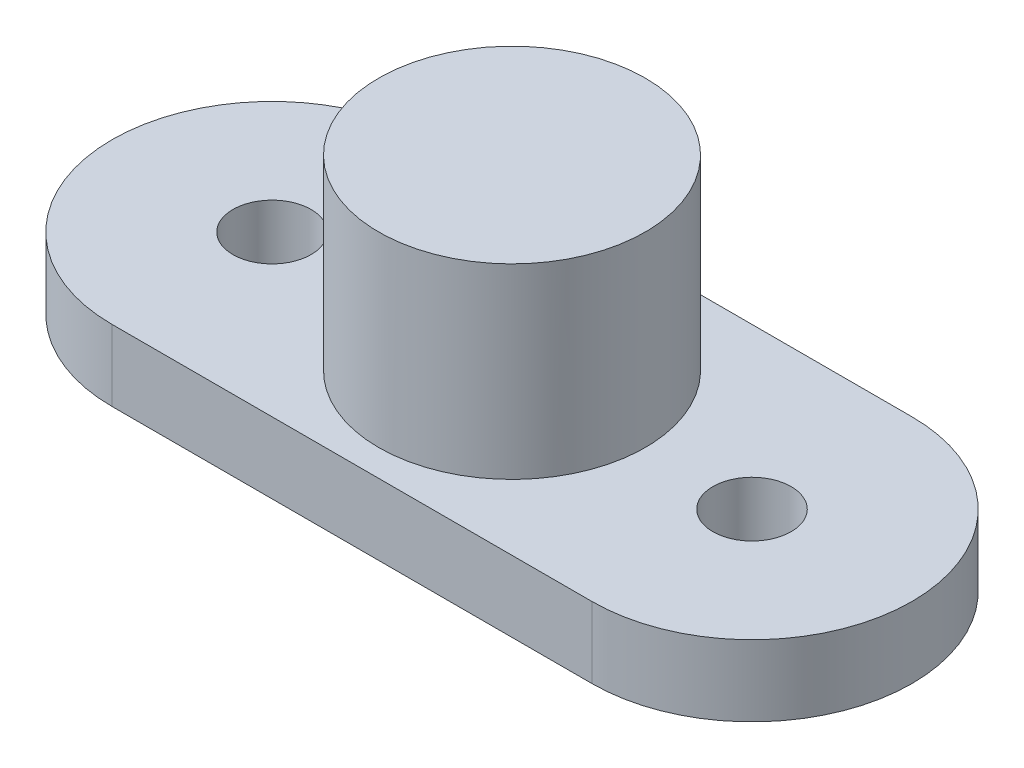
ISO-10303-21;
HEADER;
FILE_DESCRIPTION(('STEP AP214'),'2;1');
FILE_NAME('part.step','',(''),(''),'','','');
FILE_SCHEMA(('AUTOMOTIVE_DESIGN { 1 0 10303 214 1 1 1 1 }'));
ENDSEC;
DATA;
#1=APPLICATION_CONTEXT('core data for automotive mechanical design processes');
#2=APPLICATION_PROTOCOL_DEFINITION('international standard','automotive_design',2000,#1);
#3=PRODUCT_CONTEXT('',#1,'mechanical');
#4=PRODUCT('Part','Part','',(#3));
#5=PRODUCT_RELATED_PRODUCT_CATEGORY('part','',(#4));
#6=PRODUCT_DEFINITION_FORMATION('','',#4);
#7=PRODUCT_DEFINITION_CONTEXT('part definition',#1,'design');
#8=PRODUCT_DEFINITION('design','',#6,#7);
#9=PRODUCT_DEFINITION_SHAPE('','',#8);
#10=(LENGTH_UNIT() NAMED_UNIT(*) SI_UNIT(.MILLI.,.METRE.));
#11=(NAMED_UNIT(*) PLANE_ANGLE_UNIT() SI_UNIT($,.RADIAN.));
#12=(NAMED_UNIT(*) SI_UNIT($,.STERADIAN.) SOLID_ANGLE_UNIT());
#13=UNCERTAINTY_MEASURE_WITH_UNIT(LENGTH_MEASURE(1.E-05),#10,'distance_accuracy_value','');
#14=(GEOMETRIC_REPRESENTATION_CONTEXT(3) GLOBAL_UNCERTAINTY_ASSIGNED_CONTEXT((#13)) GLOBAL_UNIT_ASSIGNED_CONTEXT((#10,
#11,#12)) REPRESENTATION_CONTEXT('',''));
#15=CARTESIAN_POINT('',(0.,0.,0.));
#16=DIRECTION('',(0.,0.,1.));
#17=DIRECTION('',(1.,0.,0.));
#18=AXIS2_PLACEMENT_3D('',#15,#16,#17);
#19=CARTESIAN_POINT('',(0.,2.,-4.49950296687665));
#20=DIRECTION('',(0.,0.,-1.));
#21=DIRECTION('',(-1.,0.,0.));
#22=AXIS2_PLACEMENT_3D('',#19,#20,#21);
#23=PLANE('',#22);
#24=DIRECTION('',(1.,0.,0.));
#25=VECTOR('',#24,1.);
#26=CARTESIAN_POINT('',(0.,0.,-4.49950296687665));
#27=LINE('',#26,#25);
#28=CARTESIAN_POINT('',(-6.75,0.,-4.49950296687665));
#29=VERTEX_POINT('',#28);
#30=CARTESIAN_POINT('',(6.75,0.,-4.49950296687665));
#31=VERTEX_POINT('',#30);
#32=EDGE_CURVE('E119',#29,#31,#27,.T.);
#33=ORIENTED_EDGE('',*,*,#32,.F.);
#34=DIRECTION('',(0.,-1.,0.));
#35=VECTOR('',#34,1.);
#36=CARTESIAN_POINT('',(-6.75,2.,-4.49950296687665));
#37=LINE('',#36,#35);
#38=CARTESIAN_POINT('',(-6.75,2.,-4.49950296687665));
#39=VERTEX_POINT('',#38);
#40=EDGE_CURVE('E11',#39,#29,#37,.T.);
#41=ORIENTED_EDGE('',*,*,#40,.F.);
#42=DIRECTION('',(1.,0.,0.));
#43=VECTOR('',#42,1.);
#44=CARTESIAN_POINT('',(0.,2.,-4.49950296687665));
#45=LINE('',#44,#43);
#46=CARTESIAN_POINT('',(6.75,2.,-4.49950296687665));
#47=VERTEX_POINT('',#46);
#48=EDGE_CURVE('E96',#39,#47,#45,.T.);
#49=ORIENTED_EDGE('',*,*,#48,.T.);
#50=DIRECTION('',(0.,-1.,0.));
#51=VECTOR('',#50,1.);
#52=CARTESIAN_POINT('',(6.75,2.,-4.49950296687665));
#53=LINE('',#52,#51);
#54=EDGE_CURVE('E57',#47,#31,#53,.T.);
#55=ORIENTED_EDGE('',*,*,#54,.T.);
#56=EDGE_LOOP('',(#33,#41,#49,#55));
#57=FACE_BOUND('',#56,.T.);
#58=ADVANCED_FACE('F39',(#57),#23,.T.);
#59=CARTESIAN_POINT('',(-6.75,2.,0.));
#60=DIRECTION('',(0.,-1.,0.));
#61=DIRECTION('',(0.,0.,-1.));
#62=AXIS2_PLACEMENT_3D('',#59,#60,#61);
#63=CYLINDRICAL_SURFACE('',#62,4.49950296687665);
#64=CARTESIAN_POINT('',(-6.75,0.,0.));
#65=DIRECTION('',(0.,1.,0.));
#66=DIRECTION('',(0.,0.,1.));
#67=AXIS2_PLACEMENT_3D('',#64,#65,#66);
#68=CIRCLE('',#67,4.49950296687665);
#69=CARTESIAN_POINT('',(-6.75,0.,4.49950296687665));
#70=VERTEX_POINT('',#69);
#71=EDGE_CURVE('E102',#29,#70,#68,.T.);
#72=ORIENTED_EDGE('',*,*,#71,.T.);
#73=DIRECTION('',(0.,-1.,0.));
#74=VECTOR('',#73,1.);
#75=CARTESIAN_POINT('',(-6.75,2.,4.49950296687665));
#76=LINE('',#75,#74);
#77=CARTESIAN_POINT('',(-6.75,2.,4.49950296687665));
#78=VERTEX_POINT('',#77);
#79=EDGE_CURVE('E49',#78,#70,#76,.T.);
#80=ORIENTED_EDGE('',*,*,#79,.F.);
#81=CARTESIAN_POINT('',(-6.75,2.,0.));
#82=DIRECTION('',(0.,1.,0.));
#83=DIRECTION('',(0.,0.,1.));
#84=AXIS2_PLACEMENT_3D('',#81,#82,#83);
#85=CIRCLE('',#84,4.49950296687665);
#86=EDGE_CURVE('E92',#39,#78,#85,.T.);
#87=ORIENTED_EDGE('',*,*,#86,.F.);
#88=ORIENTED_EDGE('',*,*,#40,.T.);
#89=EDGE_LOOP('',(#72,#80,#87,#88));
#90=FACE_BOUND('',#89,.T.);
#91=ADVANCED_FACE('F100',(#90),#63,.T.);
#92=CARTESIAN_POINT('',(0.,2.,4.49950296687665));
#93=DIRECTION('',(0.,0.,-1.));
#94=DIRECTION('',(-1.,0.,0.));
#95=AXIS2_PLACEMENT_3D('',#92,#93,#94);
#96=PLANE('',#95);
#97=DIRECTION('',(1.,0.,0.));
#98=VECTOR('',#97,1.);
#99=CARTESIAN_POINT('',(0.,0.,4.49950296687665));
#100=LINE('',#99,#98);
#101=CARTESIAN_POINT('',(6.75,0.,4.49950296687665));
#102=VERTEX_POINT('',#101);
#103=EDGE_CURVE('E114',#70,#102,#100,.T.);
#104=ORIENTED_EDGE('',*,*,#103,.T.);
#105=DIRECTION('',(0.,-1.,0.));
#106=VECTOR('',#105,1.);
#107=CARTESIAN_POINT('',(6.75,2.,4.49950296687665));
#108=LINE('',#107,#106);
#109=CARTESIAN_POINT('',(6.75,2.,4.49950296687665));
#110=VERTEX_POINT('',#109);
#111=EDGE_CURVE('E71',#110,#102,#108,.T.);
#112=ORIENTED_EDGE('',*,*,#111,.F.);
#113=DIRECTION('',(1.,0.,0.));
#114=VECTOR('',#113,1.);
#115=CARTESIAN_POINT('',(0.,2.,4.49950296687665));
#116=LINE('',#115,#114);
#117=EDGE_CURVE('E83',#78,#110,#116,.T.);
#118=ORIENTED_EDGE('',*,*,#117,.F.);
#119=ORIENTED_EDGE('',*,*,#79,.T.);
#120=EDGE_LOOP('',(#104,#112,#118,#119));
#121=FACE_BOUND('',#120,.T.);
#122=ADVANCED_FACE('F85',(#121),#96,.F.);
#123=CARTESIAN_POINT('',(-6.75,2.,0.));
#124=DIRECTION('',(0.,-1.,0.));
#125=DIRECTION('',(0.,0.,-1.));
#126=AXIS2_PLACEMENT_3D('',#123,#124,#125);
#127=CYLINDRICAL_SURFACE('',#126,1.1);
#128=CARTESIAN_POINT('',(-6.75,2.,0.));
#129=DIRECTION('',(0.,1.,0.));
#130=DIRECTION('',(0.,0.,1.));
#131=AXIS2_PLACEMENT_3D('',#128,#129,#130);
#132=CIRCLE('',#131,1.1);
#133=CARTESIAN_POINT('',(-6.75,2.,1.1));
#134=VERTEX_POINT('',#133);
#135=EDGE_CURVE('E139',#134,#134,#132,.T.);
#136=ORIENTED_EDGE('',*,*,#135,.T.);
#137=EDGE_LOOP('',(#136));
#138=FACE_BOUND('',#137,.T.);
#139=CARTESIAN_POINT('',(-6.75,0.,0.));
#140=DIRECTION('',(0.,1.,0.));
#141=DIRECTION('',(0.,0.,1.));
#142=AXIS2_PLACEMENT_3D('',#139,#140,#141);
#143=CIRCLE('',#142,1.1);
#144=CARTESIAN_POINT('',(-6.75,0.,1.1));
#145=VERTEX_POINT('',#144);
#146=EDGE_CURVE('E122',#145,#145,#143,.T.);
#147=ORIENTED_EDGE('',*,*,#146,.F.);
#148=EDGE_LOOP('',(#147));
#149=FACE_BOUND('',#148,.T.);
#150=ADVANCED_FACE('F168',(#138,#149),#127,.F.);
#151=CARTESIAN_POINT('',(6.75,2.,0.));
#152=DIRECTION('',(0.,-1.,0.));
#153=DIRECTION('',(0.,0.,-1.));
#154=AXIS2_PLACEMENT_3D('',#151,#152,#153);
#155=CYLINDRICAL_SURFACE('',#154,1.1);
#156=CARTESIAN_POINT('',(6.75,2.,0.));
#157=DIRECTION('',(0.,1.,0.));
#158=DIRECTION('',(0.,0.,1.));
#159=AXIS2_PLACEMENT_3D('',#156,#157,#158);
#160=CIRCLE('',#159,1.1);
#161=CARTESIAN_POINT('',(6.75,2.,1.1));
#162=VERTEX_POINT('',#161);
#163=EDGE_CURVE('E113',#162,#162,#160,.T.);
#164=ORIENTED_EDGE('',*,*,#163,.T.);
#165=EDGE_LOOP('',(#164));
#166=FACE_BOUND('',#165,.T.);
#167=CARTESIAN_POINT('',(6.75,0.,0.));
#168=DIRECTION('',(0.,1.,0.));
#169=DIRECTION('',(0.,0.,1.));
#170=AXIS2_PLACEMENT_3D('',#167,#168,#169);
#171=CIRCLE('',#170,1.1);
#172=CARTESIAN_POINT('',(6.75,0.,1.1));
#173=VERTEX_POINT('',#172);
#174=EDGE_CURVE('E126',#173,#173,#171,.T.);
#175=ORIENTED_EDGE('',*,*,#174,.F.);
#176=EDGE_LOOP('',(#175));
#177=FACE_BOUND('',#176,.T.);
#178=ADVANCED_FACE('F41',(#166,#177),#155,.F.);
#179=CARTESIAN_POINT('',(6.75,2.,0.));
#180=DIRECTION('',(0.,-1.,0.));
#181=DIRECTION('',(0.,0.,-1.));
#182=AXIS2_PLACEMENT_3D('',#179,#180,#181);
#183=CYLINDRICAL_SURFACE('',#182,4.49950296687665);
#184=CARTESIAN_POINT('',(6.75,0.,0.));
#185=DIRECTION('',(0.,1.,0.));
#186=DIRECTION('',(0.,0.,1.));
#187=AXIS2_PLACEMENT_3D('',#184,#185,#186);
#188=CIRCLE('',#187,4.49950296687665);
#189=EDGE_CURVE('E109',#31,#102,#188,.F.);
#190=ORIENTED_EDGE('',*,*,#189,.F.);
#191=ORIENTED_EDGE('',*,*,#54,.F.);
#192=CARTESIAN_POINT('',(6.75,2.,0.));
#193=DIRECTION('',(0.,1.,0.));
#194=DIRECTION('',(0.,0.,1.));
#195=AXIS2_PLACEMENT_3D('',#192,#193,#194);
#196=CIRCLE('',#195,4.49950296687665);
#197=EDGE_CURVE('E91',#47,#110,#196,.F.);
#198=ORIENTED_EDGE('',*,*,#197,.T.);
#199=ORIENTED_EDGE('',*,*,#111,.T.);
#200=EDGE_LOOP('',(#190,#191,#198,#199));
#201=FACE_BOUND('',#200,.T.);
#202=ADVANCED_FACE('F175',(#201),#183,.T.);
#203=CARTESIAN_POINT('',(0.,2.,0.));
#204=DIRECTION('',(0.,1.,0.));
#205=DIRECTION('',(0.,0.,1.));
#206=AXIS2_PLACEMENT_3D('',#203,#204,#205);
#207=PLANE('',#206);
#208=ORIENTED_EDGE('',*,*,#163,.F.);
#209=EDGE_LOOP('',(#208));
#210=FACE_BOUND('',#209,.T.);
#211=ORIENTED_EDGE('',*,*,#135,.F.);
#212=EDGE_LOOP('',(#211));
#213=FACE_BOUND('',#212,.T.);
#214=CARTESIAN_POINT('',(0.,2.,0.));
#215=DIRECTION('',(0.,1.,0.));
#216=DIRECTION('',(0.,0.,1.));
#217=AXIS2_PLACEMENT_3D('',#214,#215,#216);
#218=CIRCLE('',#217,3.75);
#219=CARTESIAN_POINT('',(0.,2.,3.75));
#220=VERTEX_POINT('',#219);
#221=EDGE_CURVE('E135',#220,#220,#218,.T.);
#222=ORIENTED_EDGE('',*,*,#221,.F.);
#223=EDGE_LOOP('',(#222));
#224=FACE_BOUND('',#223,.T.);
#225=ORIENTED_EDGE('',*,*,#48,.F.);
#226=ORIENTED_EDGE('',*,*,#86,.T.);
#227=ORIENTED_EDGE('',*,*,#117,.T.);
#228=ORIENTED_EDGE('',*,*,#197,.F.);
#229=EDGE_LOOP('',(#225,#226,#227,#228));
#230=FACE_BOUND('',#229,.T.);
#231=ADVANCED_FACE('F95',(#210,#213,#224,#230),#207,.T.);
#232=CARTESIAN_POINT('',(0.,0.,0.));
#233=DIRECTION('',(0.,1.,0.));
#234=DIRECTION('',(0.,0.,1.));
#235=AXIS2_PLACEMENT_3D('',#232,#233,#234);
#236=PLANE('',#235);
#237=ORIENTED_EDGE('',*,*,#174,.T.);
#238=EDGE_LOOP('',(#237));
#239=FACE_BOUND('',#238,.T.);
#240=ORIENTED_EDGE('',*,*,#146,.T.);
#241=EDGE_LOOP('',(#240));
#242=FACE_BOUND('',#241,.T.);
#243=ORIENTED_EDGE('',*,*,#32,.T.);
#244=ORIENTED_EDGE('',*,*,#189,.T.);
#245=ORIENTED_EDGE('',*,*,#103,.F.);
#246=ORIENTED_EDGE('',*,*,#71,.F.);
#247=EDGE_LOOP('',(#243,#244,#245,#246));
#248=FACE_BOUND('',#247,.T.);
#249=ADVANCED_FACE('F158',(#239,#242,#248),#236,.F.);
#250=CARTESIAN_POINT('',(0.,7.25,0.));
#251=DIRECTION('',(0.,-1.,0.));
#252=DIRECTION('',(0.,0.,-1.));
#253=AXIS2_PLACEMENT_3D('',#250,#251,#252);
#254=CYLINDRICAL_SURFACE('',#253,3.75);
#255=ORIENTED_EDGE('',*,*,#221,.T.);
#256=EDGE_LOOP('',(#255));
#257=FACE_BOUND('',#256,.T.);
#258=CARTESIAN_POINT('',(0.,7.25,0.));
#259=DIRECTION('',(0.,-1.,0.));
#260=DIRECTION('',(0.,0.,-1.));
#261=AXIS2_PLACEMENT_3D('',#258,#259,#260);
#262=CIRCLE('',#261,3.75);
#263=CARTESIAN_POINT('',(0.,7.25,-3.75));
#264=VERTEX_POINT('',#263);
#265=EDGE_CURVE('E130',#264,#264,#262,.T.);
#266=ORIENTED_EDGE('',*,*,#265,.T.);
#267=EDGE_LOOP('',(#266));
#268=FACE_BOUND('',#267,.T.);
#269=ADVANCED_FACE('F150',(#257,#268),#254,.T.);
#270=CARTESIAN_POINT('',(0.,7.25,0.));
#271=DIRECTION('',(0.,-1.,0.));
#272=DIRECTION('',(0.,0.,-1.));
#273=AXIS2_PLACEMENT_3D('',#270,#271,#272);
#274=PLANE('',#273);
#275=ORIENTED_EDGE('',*,*,#265,.F.);
#276=EDGE_LOOP('',(#275));
#277=FACE_BOUND('',#276,.T.);
#278=ADVANCED_FACE('F152',(#277),#274,.F.);
#279=CLOSED_SHELL('',(#58,#91,#122,#150,#178,#202,#231,#249,#269,#278));
#280=MANIFOLD_SOLID_BREP('B2',#279);
#281=ADVANCED_BREP_SHAPE_REPRESENTATION('',(#18,#280),#14);
#282=SHAPE_DEFINITION_REPRESENTATION(#9,#281);
ENDSEC;
END-ISO-10303-21;
